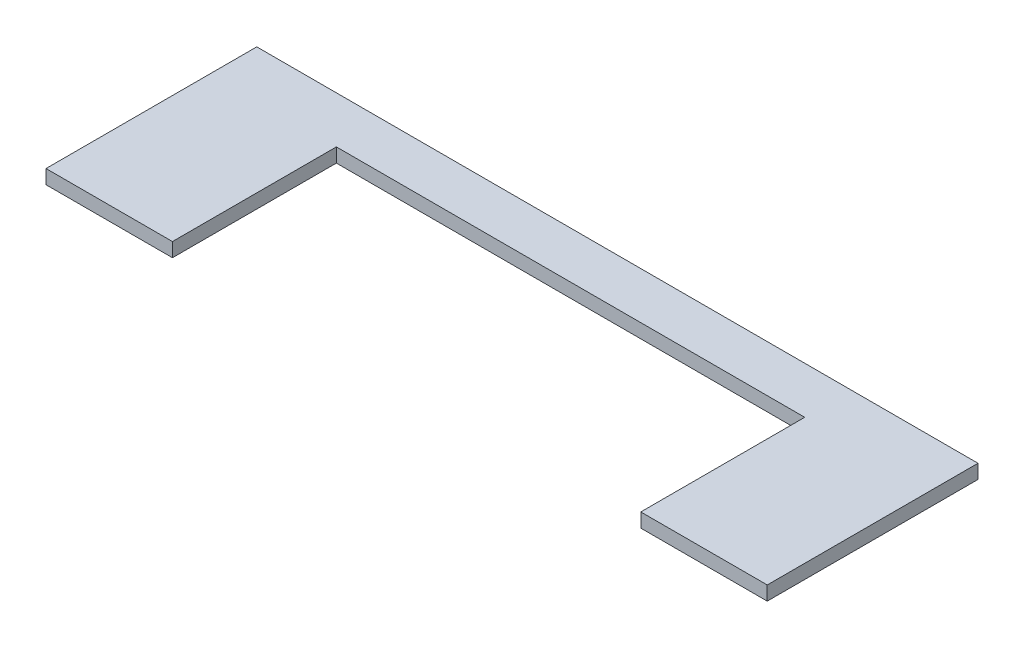
ISO-10303-21;
HEADER;
FILE_DESCRIPTION(('STEP AP214'),'2;1');
FILE_NAME('part.step','',(''),(''),'','','');
FILE_SCHEMA(('AUTOMOTIVE_DESIGN { 1 0 10303 214 1 1 1 1 }'));
ENDSEC;
DATA;
#1=APPLICATION_CONTEXT('core data for automotive mechanical design processes');
#2=APPLICATION_PROTOCOL_DEFINITION('international standard','automotive_design',2000,#1);
#3=PRODUCT_CONTEXT('',#1,'mechanical');
#4=PRODUCT('Part','Part','',(#3));
#5=PRODUCT_RELATED_PRODUCT_CATEGORY('part','',(#4));
#6=PRODUCT_DEFINITION_FORMATION('','',#4);
#7=PRODUCT_DEFINITION_CONTEXT('part definition',#1,'design');
#8=PRODUCT_DEFINITION('design','',#6,#7);
#9=PRODUCT_DEFINITION_SHAPE('','',#8);
#10=(LENGTH_UNIT() NAMED_UNIT(*) SI_UNIT(.MILLI.,.METRE.));
#11=(NAMED_UNIT(*) PLANE_ANGLE_UNIT() SI_UNIT($,.RADIAN.));
#12=(NAMED_UNIT(*) SI_UNIT($,.STERADIAN.) SOLID_ANGLE_UNIT());
#13=UNCERTAINTY_MEASURE_WITH_UNIT(LENGTH_MEASURE(1.E-05),#10,'distance_accuracy_value','');
#14=(GEOMETRIC_REPRESENTATION_CONTEXT(3) GLOBAL_UNCERTAINTY_ASSIGNED_CONTEXT((#13)) GLOBAL_UNIT_ASSIGNED_CONTEXT((#10,
#11,#12)) REPRESENTATION_CONTEXT('',''));
#15=CARTESIAN_POINT('',(0.,0.,0.));
#16=DIRECTION('',(0.,0.,1.));
#17=DIRECTION('',(1.,0.,0.));
#18=AXIS2_PLACEMENT_3D('',#15,#16,#17);
#19=CARTESIAN_POINT('',(-93.3893667120462,5.99999999999996,45.));
#20=DIRECTION('',(1.,0.,0.));
#21=DIRECTION('',(0.,0.,-1.));
#22=AXIS2_PLACEMENT_3D('',#19,#20,#21);
#23=PLANE('',#22);
#24=DIRECTION('',(0.,0.,1.));
#25=VECTOR('',#24,1.);
#26=CARTESIAN_POINT('',(-93.3893667120462,0.,45.));
#27=LINE('',#26,#25);
#28=CARTESIAN_POINT('',(-93.3893667120461,0.,-45.));
#29=VERTEX_POINT('',#28);
#30=CARTESIAN_POINT('',(-93.3893667120462,0.,45.));
#31=VERTEX_POINT('',#30);
#32=EDGE_CURVE('E127',#29,#31,#27,.T.);
#33=ORIENTED_EDGE('',*,*,#32,.T.);
#34=DIRECTION('',(0.,-1.,0.));
#35=VECTOR('',#34,1.);
#36=CARTESIAN_POINT('',(-93.3893667120462,5.99999999999996,45.));
#37=LINE('',#36,#35);
#38=CARTESIAN_POINT('',(-93.3893667120462,5.99999999999996,45.));
#39=VERTEX_POINT('',#38);
#40=EDGE_CURVE('E11',#39,#31,#37,.T.);
#41=ORIENTED_EDGE('',*,*,#40,.F.);
#42=DIRECTION('',(0.,0.,1.));
#43=VECTOR('',#42,1.);
#44=CARTESIAN_POINT('',(-93.3893667120462,5.99999999999996,45.));
#45=LINE('',#44,#43);
#46=CARTESIAN_POINT('',(-93.3893667120461,6.00000000000003,-45.));
#47=VERTEX_POINT('',#46);
#48=EDGE_CURVE('E142',#47,#39,#45,.T.);
#49=ORIENTED_EDGE('',*,*,#48,.F.);
#50=DIRECTION('',(0.,-1.,0.));
#51=VECTOR('',#50,1.);
#52=CARTESIAN_POINT('',(-93.3893667120461,6.00000000000003,-45.));
#53=LINE('',#52,#51);
#54=EDGE_CURVE('E123',#47,#29,#53,.T.);
#55=ORIENTED_EDGE('',*,*,#54,.T.);
#56=EDGE_LOOP('',(#33,#41,#49,#55));
#57=FACE_BOUND('',#56,.T.);
#58=ADVANCED_FACE('F30',(#57),#23,.F.);
#59=CARTESIAN_POINT('',(-93.3893667120462,5.99999999999996,45.));
#60=DIRECTION('',(0.,0.,-1.));
#61=DIRECTION('',(-1.,0.,0.));
#62=AXIS2_PLACEMENT_3D('',#59,#60,#61);
#63=PLANE('',#62);
#64=DIRECTION('',(1.,0.,0.));
#65=VECTOR('',#64,1.);
#66=CARTESIAN_POINT('',(-93.3893667120462,0.,45.));
#67=LINE('',#66,#65);
#68=CARTESIAN_POINT('',(-39.3893667120462,0.,45.));
#69=VERTEX_POINT('',#68);
#70=EDGE_CURVE('E130',#31,#69,#67,.T.);
#71=ORIENTED_EDGE('',*,*,#70,.T.);
#72=DIRECTION('',(0.,-1.,0.));
#73=VECTOR('',#72,1.);
#74=CARTESIAN_POINT('',(-39.3893667120462,5.99999999999996,45.));
#75=LINE('',#74,#73);
#76=CARTESIAN_POINT('',(-39.3893667120462,5.99999999999996,45.));
#77=VERTEX_POINT('',#76);
#78=EDGE_CURVE('E38',#77,#69,#75,.T.);
#79=ORIENTED_EDGE('',*,*,#78,.F.);
#80=DIRECTION('',(1.,0.,0.));
#81=VECTOR('',#80,1.);
#82=CARTESIAN_POINT('',(-93.3893667120462,5.99999999999996,45.));
#83=LINE('',#82,#81);
#84=EDGE_CURVE('E87',#39,#77,#83,.T.);
#85=ORIENTED_EDGE('',*,*,#84,.F.);
#86=ORIENTED_EDGE('',*,*,#40,.T.);
#87=EDGE_LOOP('',(#71,#79,#85,#86));
#88=FACE_BOUND('',#87,.T.);
#89=ADVANCED_FACE('F175',(#88),#63,.F.);
#90=CARTESIAN_POINT('',(-39.3893667120462,5.99999999999996,45.));
#91=DIRECTION('',(-1.,0.,0.));
#92=DIRECTION('',(0.,0.,1.));
#93=AXIS2_PLACEMENT_3D('',#90,#91,#92);
#94=PLANE('',#93);
#95=DIRECTION('',(0.,0.,-1.));
#96=VECTOR('',#95,1.);
#97=CARTESIAN_POINT('',(-39.3893667120462,0.,45.));
#98=LINE('',#97,#96);
#99=CARTESIAN_POINT('',(-39.3893667120462,0.,-25.));
#100=VERTEX_POINT('',#99);
#101=EDGE_CURVE('E132',#69,#100,#98,.T.);
#102=ORIENTED_EDGE('',*,*,#101,.T.);
#103=DIRECTION('',(0.,-1.,0.));
#104=VECTOR('',#103,1.);
#105=CARTESIAN_POINT('',(-39.3893667120462,6.00000000000002,-25.));
#106=LINE('',#105,#104);
#107=CARTESIAN_POINT('',(-39.3893667120462,6.00000000000002,-25.));
#108=VERTEX_POINT('',#107);
#109=EDGE_CURVE('E149',#108,#100,#106,.T.);
#110=ORIENTED_EDGE('',*,*,#109,.F.);
#111=DIRECTION('',(0.,0.,-1.));
#112=VECTOR('',#111,1.);
#113=CARTESIAN_POINT('',(-39.3893667120462,5.99999999999996,45.));
#114=LINE('',#113,#112);
#115=EDGE_CURVE('E157',#77,#108,#114,.T.);
#116=ORIENTED_EDGE('',*,*,#115,.F.);
#117=ORIENTED_EDGE('',*,*,#78,.T.);
#118=EDGE_LOOP('',(#102,#110,#116,#117));
#119=FACE_BOUND('',#118,.T.);
#120=ADVANCED_FACE('F155',(#119),#94,.F.);
#121=CARTESIAN_POINT('',(-39.3893667120462,6.00000000000002,-25.));
#122=DIRECTION('',(0.,0.,-1.));
#123=DIRECTION('',(-1.,0.,0.));
#124=AXIS2_PLACEMENT_3D('',#121,#122,#123);
#125=PLANE('',#124);
#126=DIRECTION('',(1.,0.,0.));
#127=VECTOR('',#126,1.);
#128=CARTESIAN_POINT('',(-39.3893667120462,0.,-25.));
#129=LINE('',#128,#127);
#130=CARTESIAN_POINT('',(160.610633287954,0.,-25.));
#131=VERTEX_POINT('',#130);
#132=EDGE_CURVE('E134',#100,#131,#129,.T.);
#133=ORIENTED_EDGE('',*,*,#132,.T.);
#134=DIRECTION('',(0.,-1.,0.));
#135=VECTOR('',#134,1.);
#136=CARTESIAN_POINT('',(160.610633287954,6.00000000000002,-25.));
#137=LINE('',#136,#135);
#138=CARTESIAN_POINT('',(160.610633287954,6.00000000000002,-25.));
#139=VERTEX_POINT('',#138);
#140=EDGE_CURVE('E146',#139,#131,#137,.T.);
#141=ORIENTED_EDGE('',*,*,#140,.F.);
#142=DIRECTION('',(1.,0.,0.));
#143=VECTOR('',#142,1.);
#144=CARTESIAN_POINT('',(-39.3893667120462,6.00000000000002,-25.));
#145=LINE('',#144,#143);
#146=EDGE_CURVE('E167',#108,#139,#145,.T.);
#147=ORIENTED_EDGE('',*,*,#146,.F.);
#148=ORIENTED_EDGE('',*,*,#109,.T.);
#149=EDGE_LOOP('',(#133,#141,#147,#148));
#150=FACE_BOUND('',#149,.T.);
#151=ADVANCED_FACE('F163',(#150),#125,.F.);
#152=CARTESIAN_POINT('',(160.610633287954,6.00000000000002,-25.));
#153=DIRECTION('',(1.,0.,0.));
#154=DIRECTION('',(0.,0.,-1.));
#155=AXIS2_PLACEMENT_3D('',#152,#153,#154);
#156=PLANE('',#155);
#157=DIRECTION('',(0.,0.,1.));
#158=VECTOR('',#157,1.);
#159=CARTESIAN_POINT('',(160.610633287954,0.,-25.));
#160=LINE('',#159,#158);
#161=CARTESIAN_POINT('',(160.610633287954,0.,45.));
#162=VERTEX_POINT('',#161);
#163=EDGE_CURVE('E136',#131,#162,#160,.T.);
#164=ORIENTED_EDGE('',*,*,#163,.T.);
#165=DIRECTION('',(0.,-1.,0.));
#166=VECTOR('',#165,1.);
#167=CARTESIAN_POINT('',(160.610633287954,5.99999999999995,45.));
#168=LINE('',#167,#166);
#169=CARTESIAN_POINT('',(160.610633287954,5.99999999999995,45.));
#170=VERTEX_POINT('',#169);
#171=EDGE_CURVE('E118',#170,#162,#168,.T.);
#172=ORIENTED_EDGE('',*,*,#171,.F.);
#173=DIRECTION('',(0.,0.,1.));
#174=VECTOR('',#173,1.);
#175=CARTESIAN_POINT('',(160.610633287954,6.00000000000002,-25.));
#176=LINE('',#175,#174);
#177=EDGE_CURVE('E107',#139,#170,#176,.T.);
#178=ORIENTED_EDGE('',*,*,#177,.F.);
#179=ORIENTED_EDGE('',*,*,#140,.T.);
#180=EDGE_LOOP('',(#164,#172,#178,#179));
#181=FACE_BOUND('',#180,.T.);
#182=ADVANCED_FACE('F166',(#181),#156,.F.);
#183=CARTESIAN_POINT('',(160.610633287954,5.99999999999995,45.));
#184=DIRECTION('',(0.,0.,-1.));
#185=DIRECTION('',(-1.,0.,0.));
#186=AXIS2_PLACEMENT_3D('',#183,#184,#185);
#187=PLANE('',#186);
#188=DIRECTION('',(1.,0.,0.));
#189=VECTOR('',#188,1.);
#190=CARTESIAN_POINT('',(160.610633287954,0.,45.));
#191=LINE('',#190,#189);
#192=CARTESIAN_POINT('',(214.610633287954,0.,45.));
#193=VERTEX_POINT('',#192);
#194=EDGE_CURVE('E116',#162,#193,#191,.T.);
#195=ORIENTED_EDGE('',*,*,#194,.T.);
#196=DIRECTION('',(0.,-1.,0.));
#197=VECTOR('',#196,1.);
#198=CARTESIAN_POINT('',(214.610633287954,5.99999999999996,45.));
#199=LINE('',#198,#197);
#200=CARTESIAN_POINT('',(214.610633287954,5.99999999999996,45.));
#201=VERTEX_POINT('',#200);
#202=EDGE_CURVE('E113',#201,#193,#199,.T.);
#203=ORIENTED_EDGE('',*,*,#202,.F.);
#204=DIRECTION('',(1.,0.,0.));
#205=VECTOR('',#204,1.);
#206=CARTESIAN_POINT('',(160.610633287954,5.99999999999995,45.));
#207=LINE('',#206,#205);
#208=EDGE_CURVE('E100',#170,#201,#207,.T.);
#209=ORIENTED_EDGE('',*,*,#208,.F.);
#210=ORIENTED_EDGE('',*,*,#171,.T.);
#211=EDGE_LOOP('',(#195,#203,#209,#210));
#212=FACE_BOUND('',#211,.T.);
#213=ADVANCED_FACE('F114',(#212),#187,.F.);
#214=CARTESIAN_POINT('',(214.610633287954,5.99999999999996,45.));
#215=DIRECTION('',(-1.,0.,0.));
#216=DIRECTION('',(0.,0.,1.));
#217=AXIS2_PLACEMENT_3D('',#214,#215,#216);
#218=PLANE('',#217);
#219=DIRECTION('',(0.,0.,-1.));
#220=VECTOR('',#219,1.);
#221=CARTESIAN_POINT('',(214.610633287954,0.,45.));
#222=LINE('',#221,#220);
#223=CARTESIAN_POINT('',(214.610633287954,0.,-45.));
#224=VERTEX_POINT('',#223);
#225=EDGE_CURVE('E139',#193,#224,#222,.T.);
#226=ORIENTED_EDGE('',*,*,#225,.T.);
#227=DIRECTION('',(0.,-1.,0.));
#228=VECTOR('',#227,1.);
#229=CARTESIAN_POINT('',(214.610633287954,6.00000000000004,-45.));
#230=LINE('',#229,#228);
#231=CARTESIAN_POINT('',(214.610633287954,6.00000000000004,-45.));
#232=VERTEX_POINT('',#231);
#233=EDGE_CURVE('E119',#232,#224,#230,.T.);
#234=ORIENTED_EDGE('',*,*,#233,.F.);
#235=DIRECTION('',(0.,0.,-1.));
#236=VECTOR('',#235,1.);
#237=CARTESIAN_POINT('',(214.610633287954,5.99999999999996,45.));
#238=LINE('',#237,#236);
#239=EDGE_CURVE('E104',#201,#232,#238,.T.);
#240=ORIENTED_EDGE('',*,*,#239,.F.);
#241=ORIENTED_EDGE('',*,*,#202,.T.);
#242=EDGE_LOOP('',(#226,#234,#240,#241));
#243=FACE_BOUND('',#242,.T.);
#244=ADVANCED_FACE('F121',(#243),#218,.F.);
#245=CARTESIAN_POINT('',(-93.3893667120461,6.00000000000003,-45.));
#246=DIRECTION('',(0.,0.,1.));
#247=DIRECTION('',(1.,0.,0.));
#248=AXIS2_PLACEMENT_3D('',#245,#246,#247);
#249=PLANE('',#248);
#250=DIRECTION('',(-1.,0.,0.));
#251=VECTOR('',#250,1.);
#252=CARTESIAN_POINT('',(-93.3893667120461,0.,-45.));
#253=LINE('',#252,#251);
#254=EDGE_CURVE('E75',#224,#29,#253,.T.);
#255=ORIENTED_EDGE('',*,*,#254,.T.);
#256=ORIENTED_EDGE('',*,*,#54,.F.);
#257=DIRECTION('',(-1.,0.,0.));
#258=VECTOR('',#257,1.);
#259=CARTESIAN_POINT('',(40.2283140387482,6.00000000000004,-45.));
#260=LINE('',#259,#258);
#261=EDGE_CURVE('E46',#232,#47,#260,.T.);
#262=ORIENTED_EDGE('',*,*,#261,.F.);
#263=ORIENTED_EDGE('',*,*,#233,.T.);
#264=EDGE_LOOP('',(#255,#256,#262,#263));
#265=FACE_BOUND('',#264,.T.);
#266=ADVANCED_FACE('F191',(#265),#249,.F.);
#267=CARTESIAN_POINT('',(0.,6.,0.));
#268=DIRECTION('',(0.,-1.,0.));
#269=DIRECTION('',(0.,0.,-1.));
#270=AXIS2_PLACEMENT_3D('',#267,#268,#269);
#271=PLANE('',#270);
#272=ORIENTED_EDGE('',*,*,#48,.T.);
#273=ORIENTED_EDGE('',*,*,#84,.T.);
#274=ORIENTED_EDGE('',*,*,#115,.T.);
#275=ORIENTED_EDGE('',*,*,#146,.T.);
#276=ORIENTED_EDGE('',*,*,#177,.T.);
#277=ORIENTED_EDGE('',*,*,#208,.T.);
#278=ORIENTED_EDGE('',*,*,#239,.T.);
#279=ORIENTED_EDGE('',*,*,#261,.T.);
#280=EDGE_LOOP('',(#272,#273,#274,#275,#276,#277,#278,#279));
#281=FACE_BOUND('',#280,.T.);
#282=ADVANCED_FACE('F102',(#281),#271,.F.);
#283=CARTESIAN_POINT('',(0.,0.,0.));
#284=DIRECTION('',(0.,-1.,0.));
#285=DIRECTION('',(0.,0.,-1.));
#286=AXIS2_PLACEMENT_3D('',#283,#284,#285);
#287=PLANE('',#286);
#288=ORIENTED_EDGE('',*,*,#32,.F.);
#289=ORIENTED_EDGE('',*,*,#254,.F.);
#290=ORIENTED_EDGE('',*,*,#225,.F.);
#291=ORIENTED_EDGE('',*,*,#194,.F.);
#292=ORIENTED_EDGE('',*,*,#163,.F.);
#293=ORIENTED_EDGE('',*,*,#132,.F.);
#294=ORIENTED_EDGE('',*,*,#101,.F.);
#295=ORIENTED_EDGE('',*,*,#70,.F.);
#296=EDGE_LOOP('',(#288,#289,#290,#291,#292,#293,#294,#295));
#297=FACE_BOUND('',#296,.T.);
#298=ADVANCED_FACE('F159',(#297),#287,.T.);
#299=CLOSED_SHELL('',(#58,#89,#120,#151,#182,#213,#244,#266,#282,#298));
#300=MANIFOLD_SOLID_BREP('B2',#299);
#301=ADVANCED_BREP_SHAPE_REPRESENTATION('',(#18,#300),#14);
#302=SHAPE_DEFINITION_REPRESENTATION(#9,#301);
ENDSEC;
END-ISO-10303-21;
